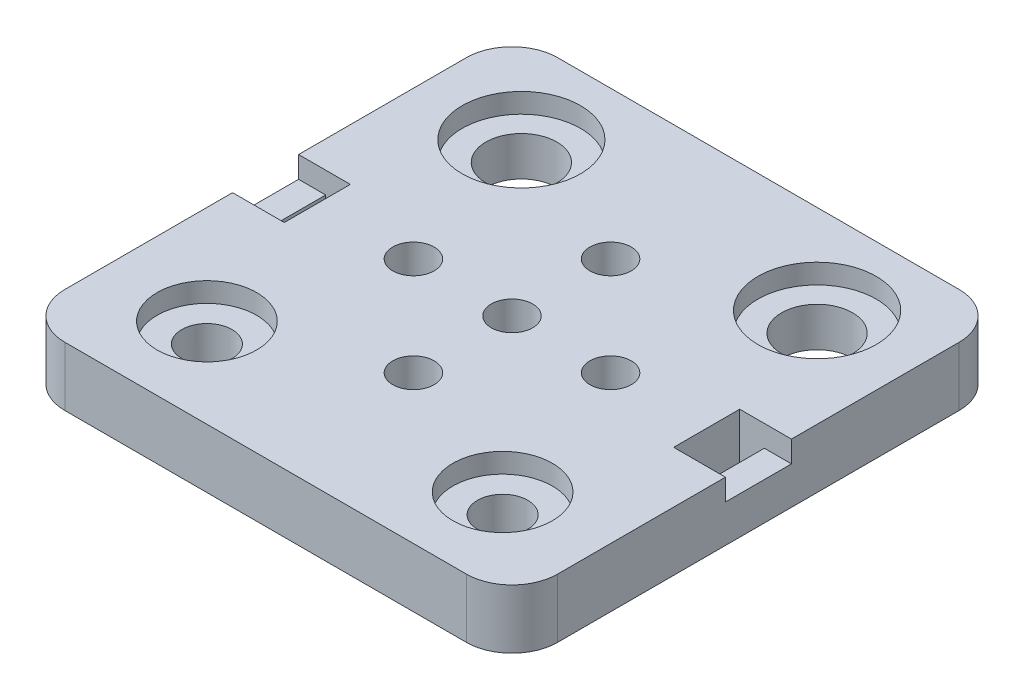
ISO-10303-21;
HEADER;
FILE_DESCRIPTION(('STEP AP214'),'2;1');
FILE_NAME('part.step','',(''),(''),'','','');
FILE_SCHEMA(('AUTOMOTIVE_DESIGN { 1 0 10303 214 1 1 1 1 }'));
ENDSEC;
DATA;
#1=APPLICATION_CONTEXT('core data for automotive mechanical design processes');
#2=APPLICATION_PROTOCOL_DEFINITION('international standard','automotive_design',2000,#1);
#3=PRODUCT_CONTEXT('',#1,'mechanical');
#4=PRODUCT('Part','Part','',(#3));
#5=PRODUCT_RELATED_PRODUCT_CATEGORY('part','',(#4));
#6=PRODUCT_DEFINITION_FORMATION('','',#4);
#7=PRODUCT_DEFINITION_CONTEXT('part definition',#1,'design');
#8=PRODUCT_DEFINITION('design','',#6,#7);
#9=PRODUCT_DEFINITION_SHAPE('','',#8);
#10=(LENGTH_UNIT() NAMED_UNIT(*) SI_UNIT(.MILLI.,.METRE.));
#11=(NAMED_UNIT(*) PLANE_ANGLE_UNIT() SI_UNIT($,.RADIAN.));
#12=(NAMED_UNIT(*) SI_UNIT($,.STERADIAN.) SOLID_ANGLE_UNIT());
#13=UNCERTAINTY_MEASURE_WITH_UNIT(LENGTH_MEASURE(1.E-05),#10,'distance_accuracy_value','');
#14=(GEOMETRIC_REPRESENTATION_CONTEXT(3) GLOBAL_UNCERTAINTY_ASSIGNED_CONTEXT((#13)) GLOBAL_UNIT_ASSIGNED_CONTEXT((#10,
#11,#12)) REPRESENTATION_CONTEXT('',''));
#15=CARTESIAN_POINT('',(0.,0.,0.));
#16=DIRECTION('',(0.,0.,1.));
#17=DIRECTION('',(1.,0.,0.));
#18=AXIS2_PLACEMENT_3D('',#15,#16,#17);
#19=CARTESIAN_POINT('',(-15.,6.,15.95));
#20=DIRECTION('',(0.,-1.,0.));
#21=DIRECTION('',(0.,0.,-1.));
#22=AXIS2_PLACEMENT_3D('',#19,#20,#21);
#23=CYLINDRICAL_SURFACE('',#22,2.55);
#24=CARTESIAN_POINT('',(-15.,0.,15.95));
#25=DIRECTION('',(0.,1.,0.));
#26=DIRECTION('',(0.,0.,-1.));
#27=AXIS2_PLACEMENT_3D('',#24,#25,#26);
#28=CIRCLE('',#27,2.55);
#29=CARTESIAN_POINT('',(-15.,0.,13.4));
#30=VERTEX_POINT('',#29);
#31=EDGE_CURVE('E323',#30,#30,#28,.T.);
#32=ORIENTED_EDGE('',*,*,#31,.F.);
#33=EDGE_LOOP('',(#32));
#34=FACE_BOUND('',#33,.T.);
#35=CARTESIAN_POINT('',(-15.,4.,15.95));
#36=DIRECTION('',(0.,1.,0.));
#37=DIRECTION('',(0.,0.,1.));
#38=AXIS2_PLACEMENT_3D('',#35,#36,#37);
#39=CIRCLE('',#38,2.55);
#40=CARTESIAN_POINT('',(-15.,4.,18.5));
#41=VERTEX_POINT('',#40);
#42=EDGE_CURVE('E38',#41,#41,#39,.T.);
#43=ORIENTED_EDGE('',*,*,#42,.T.);
#44=EDGE_LOOP('',(#43));
#45=FACE_BOUND('',#44,.T.);
#46=ADVANCED_FACE('F34',(#34,#45),#23,.F.);
#47=CARTESIAN_POINT('',(15.,6.,15.95));
#48=DIRECTION('',(0.,-1.,0.));
#49=DIRECTION('',(0.,0.,-1.));
#50=AXIS2_PLACEMENT_3D('',#47,#48,#49);
#51=CYLINDRICAL_SURFACE('',#50,2.55);
#52=CARTESIAN_POINT('',(15.,0.,15.95));
#53=DIRECTION('',(0.,1.,0.));
#54=DIRECTION('',(0.,0.,1.));
#55=AXIS2_PLACEMENT_3D('',#52,#53,#54);
#56=CIRCLE('',#55,2.55);
#57=CARTESIAN_POINT('',(15.,0.,18.5));
#58=VERTEX_POINT('',#57);
#59=EDGE_CURVE('E326',#58,#58,#56,.T.);
#60=ORIENTED_EDGE('',*,*,#59,.F.);
#61=EDGE_LOOP('',(#60));
#62=FACE_BOUND('',#61,.T.);
#63=CARTESIAN_POINT('',(15.,4.,15.95));
#64=DIRECTION('',(0.,1.,0.));
#65=DIRECTION('',(0.,0.,1.));
#66=AXIS2_PLACEMENT_3D('',#63,#64,#65);
#67=CIRCLE('',#66,2.55);
#68=CARTESIAN_POINT('',(15.,4.,18.5));
#69=VERTEX_POINT('',#68);
#70=EDGE_CURVE('E275',#69,#69,#67,.T.);
#71=ORIENTED_EDGE('',*,*,#70,.T.);
#72=EDGE_LOOP('',(#71));
#73=FACE_BOUND('',#72,.T.);
#74=ADVANCED_FACE('F399',(#62,#73),#51,.F.);
#75=CARTESIAN_POINT('',(15.,6.,-15.95));
#76=DIRECTION('',(0.,-1.,0.));
#77=DIRECTION('',(0.,0.,-1.));
#78=AXIS2_PLACEMENT_3D('',#75,#76,#77);
#79=CYLINDRICAL_SURFACE('',#78,3.6);
#80=CARTESIAN_POINT('',(15.,0.,-15.95));
#81=DIRECTION('',(0.,1.,0.));
#82=DIRECTION('',(0.,0.,-1.));
#83=AXIS2_PLACEMENT_3D('',#80,#81,#82);
#84=CIRCLE('',#83,3.6);
#85=CARTESIAN_POINT('',(15.,0.,-19.55));
#86=VERTEX_POINT('',#85);
#87=EDGE_CURVE('E329',#86,#86,#84,.T.);
#88=ORIENTED_EDGE('',*,*,#87,.F.);
#89=EDGE_LOOP('',(#88));
#90=FACE_BOUND('',#89,.T.);
#91=CARTESIAN_POINT('',(15.,4.,-15.95));
#92=DIRECTION('',(0.,1.,0.));
#93=DIRECTION('',(0.,0.,1.));
#94=AXIS2_PLACEMENT_3D('',#91,#92,#93);
#95=CIRCLE('',#94,3.6);
#96=CARTESIAN_POINT('',(15.,4.,-12.35));
#97=VERTEX_POINT('',#96);
#98=EDGE_CURVE('E282',#97,#97,#95,.T.);
#99=ORIENTED_EDGE('',*,*,#98,.T.);
#100=EDGE_LOOP('',(#99));
#101=FACE_BOUND('',#100,.T.);
#102=ADVANCED_FACE('F458',(#90,#101),#79,.F.);
#103=CARTESIAN_POINT('',(-15.,6.,-15.95));
#104=DIRECTION('',(0.,-1.,0.));
#105=DIRECTION('',(0.,0.,-1.));
#106=AXIS2_PLACEMENT_3D('',#103,#104,#105);
#107=CYLINDRICAL_SURFACE('',#106,3.6);
#108=CARTESIAN_POINT('',(-15.,0.,-15.95));
#109=DIRECTION('',(0.,1.,0.));
#110=DIRECTION('',(0.,0.,1.));
#111=AXIS2_PLACEMENT_3D('',#108,#109,#110);
#112=CIRCLE('',#111,3.6);
#113=CARTESIAN_POINT('',(-15.,0.,-12.35));
#114=VERTEX_POINT('',#113);
#115=EDGE_CURVE('E332',#114,#114,#112,.T.);
#116=ORIENTED_EDGE('',*,*,#115,.F.);
#117=EDGE_LOOP('',(#116));
#118=FACE_BOUND('',#117,.T.);
#119=CARTESIAN_POINT('',(-15.,4.,-15.95));
#120=DIRECTION('',(0.,1.,0.));
#121=DIRECTION('',(0.,0.,1.));
#122=AXIS2_PLACEMENT_3D('',#119,#120,#121);
#123=CIRCLE('',#122,3.6);
#124=CARTESIAN_POINT('',(-15.,4.,-12.35));
#125=VERTEX_POINT('',#124);
#126=EDGE_CURVE('E289',#125,#125,#123,.T.);
#127=ORIENTED_EDGE('',*,*,#126,.T.);
#128=EDGE_LOOP('',(#127));
#129=FACE_BOUND('',#128,.T.);
#130=ADVANCED_FACE('F418',(#118,#129),#107,.F.);
#131=CARTESIAN_POINT('',(-20.365,6.,-20.365));
#132=DIRECTION('',(0.,1.,0.));
#133=DIRECTION('',(0.,0.,1.));
#134=AXIS2_PLACEMENT_3D('',#131,#132,#133);
#135=PLANE('',#134);
#136=DIRECTION('',(-1.,0.,0.));
#137=VECTOR('',#136,1.);
#138=CARTESIAN_POINT('',(25.,6.,-3.35));
#139=LINE('',#138,#137);
#140=CARTESIAN_POINT('',(25.,6.,-3.35));
#141=VERTEX_POINT('',#140);
#142=CARTESIAN_POINT('',(19.75,6.,-3.35));
#143=VERTEX_POINT('',#142);
#144=EDGE_CURVE('E180',#141,#143,#139,.T.);
#145=ORIENTED_EDGE('',*,*,#144,.F.);
#146=DIRECTION('',(0.,0.,-1.));
#147=VECTOR('',#146,1.);
#148=CARTESIAN_POINT('',(25.,6.,20.365));
#149=LINE('',#148,#147);
#150=CARTESIAN_POINT('',(25.,6.,-20.365));
#151=VERTEX_POINT('',#150);
#152=EDGE_CURVE('E350',#141,#151,#149,.T.);
#153=ORIENTED_EDGE('',*,*,#152,.T.);
#154=CARTESIAN_POINT('',(20.365,6.,-20.365));
#155=DIRECTION('',(0.,1.,0.));
#156=DIRECTION('',(0.,0.,1.));
#157=AXIS2_PLACEMENT_3D('',#154,#155,#156);
#158=CIRCLE('',#157,4.635);
#159=CARTESIAN_POINT('',(20.365,6.,-25.));
#160=VERTEX_POINT('',#159);
#161=EDGE_CURVE('E354',#151,#160,#158,.T.);
#162=ORIENTED_EDGE('',*,*,#161,.T.);
#163=DIRECTION('',(-1.,0.,0.));
#164=VECTOR('',#163,1.);
#165=CARTESIAN_POINT('',(20.365,6.,-25.));
#166=LINE('',#165,#164);
#167=CARTESIAN_POINT('',(-20.365,6.,-25.));
#168=VERTEX_POINT('',#167);
#169=EDGE_CURVE('E356',#160,#168,#166,.T.);
#170=ORIENTED_EDGE('',*,*,#169,.T.);
#171=CARTESIAN_POINT('',(-20.365,6.,-20.365));
#172=DIRECTION('',(0.,1.,0.));
#173=DIRECTION('',(0.,0.,1.));
#174=AXIS2_PLACEMENT_3D('',#171,#172,#173);
#175=CIRCLE('',#174,4.635);
#176=CARTESIAN_POINT('',(-25.,6.,-20.365));
#177=VERTEX_POINT('',#176);
#178=EDGE_CURVE('E336',#168,#177,#175,.T.);
#179=ORIENTED_EDGE('',*,*,#178,.T.);
#180=DIRECTION('',(0.,0.,1.));
#181=VECTOR('',#180,1.);
#182=CARTESIAN_POINT('',(-25.,6.,20.365));
#183=LINE('',#182,#181);
#184=CARTESIAN_POINT('',(-25.,6.,-3.35));
#185=VERTEX_POINT('',#184);
#186=EDGE_CURVE('E341',#177,#185,#183,.T.);
#187=ORIENTED_EDGE('',*,*,#186,.T.);
#188=DIRECTION('',(-1.,0.,0.));
#189=VECTOR('',#188,1.);
#190=CARTESIAN_POINT('',(-25.,6.,-3.35));
#191=LINE('',#190,#189);
#192=CARTESIAN_POINT('',(-19.75,6.,-3.35));
#193=VERTEX_POINT('',#192);
#194=EDGE_CURVE('E246',#193,#185,#191,.T.);
#195=ORIENTED_EDGE('',*,*,#194,.F.);
#196=DIRECTION('',(0.,0.,-1.));
#197=VECTOR('',#196,1.);
#198=CARTESIAN_POINT('',(-19.75,6.,-3.35));
#199=LINE('',#198,#197);
#200=CARTESIAN_POINT('',(-19.75,6.,3.35));
#201=VERTEX_POINT('',#200);
#202=EDGE_CURVE('E254',#201,#193,#199,.T.);
#203=ORIENTED_EDGE('',*,*,#202,.F.);
#204=DIRECTION('',(1.,0.,0.));
#205=VECTOR('',#204,1.);
#206=CARTESIAN_POINT('',(-25.,6.,3.35));
#207=LINE('',#206,#205);
#208=CARTESIAN_POINT('',(-25.,6.,3.35));
#209=VERTEX_POINT('',#208);
#210=EDGE_CURVE('E237',#209,#201,#207,.T.);
#211=ORIENTED_EDGE('',*,*,#210,.F.);
#212=CARTESIAN_POINT('',(-25.,6.,20.365));
#213=VERTEX_POINT('',#212);
#214=EDGE_CURVE('E339',#209,#213,#183,.T.);
#215=ORIENTED_EDGE('',*,*,#214,.T.);
#216=CARTESIAN_POINT('',(-20.365,6.,20.365));
#217=DIRECTION('',(0.,1.,0.));
#218=DIRECTION('',(0.,0.,-1.));
#219=AXIS2_PLACEMENT_3D('',#216,#217,#218);
#220=CIRCLE('',#219,4.635);
#221=CARTESIAN_POINT('',(-20.365,6.,25.));
#222=VERTEX_POINT('',#221);
#223=EDGE_CURVE('E344',#213,#222,#220,.T.);
#224=ORIENTED_EDGE('',*,*,#223,.T.);
#225=DIRECTION('',(1.,0.,0.));
#226=VECTOR('',#225,1.);
#227=CARTESIAN_POINT('',(20.365,6.,25.));
#228=LINE('',#227,#226);
#229=CARTESIAN_POINT('',(20.365,6.,25.));
#230=VERTEX_POINT('',#229);
#231=EDGE_CURVE('E346',#222,#230,#228,.T.);
#232=ORIENTED_EDGE('',*,*,#231,.T.);
#233=CARTESIAN_POINT('',(20.365,6.,20.365));
#234=DIRECTION('',(0.,1.,0.));
#235=DIRECTION('',(0.,0.,1.));
#236=AXIS2_PLACEMENT_3D('',#233,#234,#235);
#237=CIRCLE('',#236,4.635);
#238=CARTESIAN_POINT('',(25.,6.,20.365));
#239=VERTEX_POINT('',#238);
#240=EDGE_CURVE('E348',#230,#239,#237,.T.);
#241=ORIENTED_EDGE('',*,*,#240,.T.);
#242=CARTESIAN_POINT('',(25.,6.,3.35));
#243=VERTEX_POINT('',#242);
#244=EDGE_CURVE('E351',#239,#243,#149,.T.);
#245=ORIENTED_EDGE('',*,*,#244,.T.);
#246=DIRECTION('',(1.,0.,0.));
#247=VECTOR('',#246,1.);
#248=CARTESIAN_POINT('',(25.,6.,3.35));
#249=LINE('',#248,#247);
#250=CARTESIAN_POINT('',(19.75,6.,3.35));
#251=VERTEX_POINT('',#250);
#252=EDGE_CURVE('E227',#251,#243,#249,.T.);
#253=ORIENTED_EDGE('',*,*,#252,.F.);
#254=DIRECTION('',(0.,0.,1.));
#255=VECTOR('',#254,1.);
#256=CARTESIAN_POINT('',(19.75,6.,-3.35));
#257=LINE('',#256,#255);
#258=EDGE_CURVE('E232',#143,#251,#257,.T.);
#259=ORIENTED_EDGE('',*,*,#258,.F.);
#260=EDGE_LOOP('',(#145,#153,#162,#170,#179,#187,#195,#203,#211,#215,#224,#232,#241,#245,#253,#259));
#261=FACE_BOUND('',#260,.T.);
#262=CARTESIAN_POINT('',(-15.,6.,15.95));
#263=DIRECTION('',(0.,1.,0.));
#264=DIRECTION('',(0.,0.,1.));
#265=AXIS2_PLACEMENT_3D('',#262,#263,#264);
#266=CIRCLE('',#265,5.05);
#267=CARTESIAN_POINT('',(-15.,6.,21.));
#268=VERTEX_POINT('',#267);
#269=EDGE_CURVE('E261',#268,#268,#266,.T.);
#270=ORIENTED_EDGE('',*,*,#269,.F.);
#271=EDGE_LOOP('',(#270));
#272=FACE_BOUND('',#271,.T.);
#273=CARTESIAN_POINT('',(15.,6.,15.95));
#274=DIRECTION('',(0.,1.,0.));
#275=DIRECTION('',(0.,0.,1.));
#276=AXIS2_PLACEMENT_3D('',#273,#274,#275);
#277=CIRCLE('',#276,5.05);
#278=CARTESIAN_POINT('',(15.,6.,21.));
#279=VERTEX_POINT('',#278);
#280=EDGE_CURVE('E276',#279,#279,#277,.T.);
#281=ORIENTED_EDGE('',*,*,#280,.F.);
#282=EDGE_LOOP('',(#281));
#283=FACE_BOUND('',#282,.T.);
#284=CARTESIAN_POINT('',(15.,6.,-15.95));
#285=DIRECTION('',(0.,1.,0.));
#286=DIRECTION('',(0.,0.,1.));
#287=AXIS2_PLACEMENT_3D('',#284,#285,#286);
#288=CIRCLE('',#287,6.00000000000001);
#289=CARTESIAN_POINT('',(15.,6.,-9.94999999999998));
#290=VERTEX_POINT('',#289);
#291=EDGE_CURVE('E283',#290,#290,#288,.T.);
#292=ORIENTED_EDGE('',*,*,#291,.F.);
#293=EDGE_LOOP('',(#292));
#294=FACE_BOUND('',#293,.T.);
#295=CARTESIAN_POINT('',(-15.,6.,-15.95));
#296=DIRECTION('',(0.,1.,0.));
#297=DIRECTION('',(0.,0.,1.));
#298=AXIS2_PLACEMENT_3D('',#295,#296,#297);
#299=CIRCLE('',#298,6.);
#300=CARTESIAN_POINT('',(-15.,6.,-9.94999999999998));
#301=VERTEX_POINT('',#300);
#302=EDGE_CURVE('E290',#301,#301,#299,.T.);
#303=ORIENTED_EDGE('',*,*,#302,.F.);
#304=EDGE_LOOP('',(#303));
#305=FACE_BOUND('',#304,.T.);
#306=CARTESIAN_POINT('',(0.,6.,-10.));
#307=DIRECTION('',(0.,1.,0.));
#308=DIRECTION('',(0.,0.,1.));
#309=AXIS2_PLACEMENT_3D('',#306,#307,#308);
#310=CIRCLE('',#309,2.1);
#311=CARTESIAN_POINT('',(0.,6.,-7.9));
#312=VERTEX_POINT('',#311);
#313=EDGE_CURVE('E293',#312,#312,#310,.T.);
#314=ORIENTED_EDGE('',*,*,#313,.F.);
#315=EDGE_LOOP('',(#314));
#316=FACE_BOUND('',#315,.T.);
#317=CARTESIAN_POINT('',(-10.,6.,0.));
#318=DIRECTION('',(0.,1.,0.));
#319=DIRECTION('',(0.,0.,1.));
#320=AXIS2_PLACEMENT_3D('',#317,#318,#319);
#321=CIRCLE('',#320,2.1);
#322=CARTESIAN_POINT('',(-10.,6.,2.1));
#323=VERTEX_POINT('',#322);
#324=EDGE_CURVE('E299',#323,#323,#321,.T.);
#325=ORIENTED_EDGE('',*,*,#324,.F.);
#326=EDGE_LOOP('',(#325));
#327=FACE_BOUND('',#326,.T.);
#328=CARTESIAN_POINT('',(0.,6.,0.));
#329=DIRECTION('',(0.,1.,0.));
#330=DIRECTION('',(0.,0.,1.));
#331=AXIS2_PLACEMENT_3D('',#328,#329,#330);
#332=CIRCLE('',#331,2.1);
#333=CARTESIAN_POINT('',(0.,6.,2.1));
#334=VERTEX_POINT('',#333);
#335=EDGE_CURVE('E305',#334,#334,#332,.T.);
#336=ORIENTED_EDGE('',*,*,#335,.F.);
#337=EDGE_LOOP('',(#336));
#338=FACE_BOUND('',#337,.T.);
#339=CARTESIAN_POINT('',(0.,6.,10.));
#340=DIRECTION('',(0.,1.,0.));
#341=DIRECTION('',(0.,0.,1.));
#342=AXIS2_PLACEMENT_3D('',#339,#340,#341);
#343=CIRCLE('',#342,2.1);
#344=CARTESIAN_POINT('',(0.,6.,12.1));
#345=VERTEX_POINT('',#344);
#346=EDGE_CURVE('E311',#345,#345,#343,.T.);
#347=ORIENTED_EDGE('',*,*,#346,.F.);
#348=EDGE_LOOP('',(#347));
#349=FACE_BOUND('',#348,.T.);
#350=CARTESIAN_POINT('',(10.,6.,0.));
#351=DIRECTION('',(0.,1.,0.));
#352=DIRECTION('',(0.,0.,1.));
#353=AXIS2_PLACEMENT_3D('',#350,#351,#352);
#354=CIRCLE('',#353,2.1);
#355=CARTESIAN_POINT('',(10.,6.,2.1));
#356=VERTEX_POINT('',#355);
#357=EDGE_CURVE('E317',#356,#356,#354,.T.);
#358=ORIENTED_EDGE('',*,*,#357,.F.);
#359=EDGE_LOOP('',(#358));
#360=FACE_BOUND('',#359,.T.);
#361=ADVANCED_FACE('F415',(#261,#272,#283,#294,#305,#316,#327,#338,#349,#360),#135,.T.);
#362=CARTESIAN_POINT('',(-20.365,0.,-20.365));
#363=DIRECTION('',(0.,1.,0.));
#364=DIRECTION('',(0.,0.,1.));
#365=AXIS2_PLACEMENT_3D('',#362,#363,#364);
#366=PLANE('',#365);
#367=DIRECTION('',(0.,0.,-1.));
#368=VECTOR('',#367,1.);
#369=CARTESIAN_POINT('',(22.25,0.,-3.35));
#370=LINE('',#369,#368);
#371=CARTESIAN_POINT('',(22.25,0.,3.35));
#372=VERTEX_POINT('',#371);
#373=CARTESIAN_POINT('',(22.25,0.,-3.35));
#374=VERTEX_POINT('',#373);
#375=EDGE_CURVE('E194',#372,#374,#370,.T.);
#376=ORIENTED_EDGE('',*,*,#375,.T.);
#377=DIRECTION('',(-1.,0.,0.));
#378=VECTOR('',#377,1.);
#379=CARTESIAN_POINT('',(19.75,0.,-3.35));
#380=LINE('',#379,#378);
#381=CARTESIAN_POINT('',(19.75,0.,-3.35));
#382=VERTEX_POINT('',#381);
#383=EDGE_CURVE('E177',#374,#382,#380,.T.);
#384=ORIENTED_EDGE('',*,*,#383,.T.);
#385=DIRECTION('',(0.,0.,1.));
#386=VECTOR('',#385,1.);
#387=CARTESIAN_POINT('',(19.75,0.,-3.35));
#388=LINE('',#387,#386);
#389=CARTESIAN_POINT('',(19.75,0.,3.35));
#390=VERTEX_POINT('',#389);
#391=EDGE_CURVE('E185',#382,#390,#388,.T.);
#392=ORIENTED_EDGE('',*,*,#391,.T.);
#393=DIRECTION('',(1.,0.,0.));
#394=VECTOR('',#393,1.);
#395=CARTESIAN_POINT('',(19.75,0.,3.35));
#396=LINE('',#395,#394);
#397=EDGE_CURVE('E189',#390,#372,#396,.T.);
#398=ORIENTED_EDGE('',*,*,#397,.T.);
#399=EDGE_LOOP('',(#376,#384,#392,#398));
#400=FACE_BOUND('',#399,.T.);
#401=DIRECTION('',(1.,0.,0.));
#402=VECTOR('',#401,1.);
#403=CARTESIAN_POINT('',(-19.75,0.,3.35));
#404=LINE('',#403,#402);
#405=CARTESIAN_POINT('',(-22.25,0.,3.35));
#406=VERTEX_POINT('',#405);
#407=CARTESIAN_POINT('',(-19.75,0.,3.35));
#408=VERTEX_POINT('',#407);
#409=EDGE_CURVE('E214',#406,#408,#404,.T.);
#410=ORIENTED_EDGE('',*,*,#409,.T.);
#411=DIRECTION('',(0.,0.,-1.));
#412=VECTOR('',#411,1.);
#413=CARTESIAN_POINT('',(-19.75,0.,-3.35));
#414=LINE('',#413,#412);
#415=CARTESIAN_POINT('',(-19.75,0.,-3.35));
#416=VERTEX_POINT('',#415);
#417=EDGE_CURVE('E207',#408,#416,#414,.T.);
#418=ORIENTED_EDGE('',*,*,#417,.T.);
#419=DIRECTION('',(-1.,0.,0.));
#420=VECTOR('',#419,1.);
#421=CARTESIAN_POINT('',(-19.75,0.,-3.35));
#422=LINE('',#421,#420);
#423=CARTESIAN_POINT('',(-22.25,0.,-3.35));
#424=VERTEX_POINT('',#423);
#425=EDGE_CURVE('E210',#416,#424,#422,.T.);
#426=ORIENTED_EDGE('',*,*,#425,.T.);
#427=DIRECTION('',(0.,0.,1.));
#428=VECTOR('',#427,1.);
#429=CARTESIAN_POINT('',(-22.25,0.,-3.35));
#430=LINE('',#429,#428);
#431=EDGE_CURVE('E59',#424,#406,#430,.T.);
#432=ORIENTED_EDGE('',*,*,#431,.T.);
#433=EDGE_LOOP('',(#410,#418,#426,#432));
#434=FACE_BOUND('',#433,.T.);
#435=CARTESIAN_POINT('',(0.,0.,-10.));
#436=DIRECTION('',(0.,1.,0.));
#437=DIRECTION('',(0.,0.,1.));
#438=AXIS2_PLACEMENT_3D('',#435,#436,#437);
#439=CIRCLE('',#438,2.1);
#440=CARTESIAN_POINT('',(0.,0.,-7.9));
#441=VERTEX_POINT('',#440);
#442=EDGE_CURVE('E296',#441,#441,#439,.T.);
#443=ORIENTED_EDGE('',*,*,#442,.T.);
#444=EDGE_LOOP('',(#443));
#445=FACE_BOUND('',#444,.T.);
#446=CARTESIAN_POINT('',(-10.,0.,0.));
#447=DIRECTION('',(0.,1.,0.));
#448=DIRECTION('',(0.,0.,1.));
#449=AXIS2_PLACEMENT_3D('',#446,#447,#448);
#450=CIRCLE('',#449,2.1);
#451=CARTESIAN_POINT('',(-10.,0.,2.1));
#452=VERTEX_POINT('',#451);
#453=EDGE_CURVE('E302',#452,#452,#450,.T.);
#454=ORIENTED_EDGE('',*,*,#453,.T.);
#455=EDGE_LOOP('',(#454));
#456=FACE_BOUND('',#455,.T.);
#457=CARTESIAN_POINT('',(0.,0.,0.));
#458=DIRECTION('',(0.,1.,0.));
#459=DIRECTION('',(0.,0.,1.));
#460=AXIS2_PLACEMENT_3D('',#457,#458,#459);
#461=CIRCLE('',#460,2.1);
#462=CARTESIAN_POINT('',(0.,0.,2.1));
#463=VERTEX_POINT('',#462);
#464=EDGE_CURVE('E308',#463,#463,#461,.T.);
#465=ORIENTED_EDGE('',*,*,#464,.T.);
#466=EDGE_LOOP('',(#465));
#467=FACE_BOUND('',#466,.T.);
#468=CARTESIAN_POINT('',(0.,0.,10.));
#469=DIRECTION('',(0.,1.,0.));
#470=DIRECTION('',(0.,0.,1.));
#471=AXIS2_PLACEMENT_3D('',#468,#469,#470);
#472=CIRCLE('',#471,2.1);
#473=CARTESIAN_POINT('',(0.,0.,12.1));
#474=VERTEX_POINT('',#473);
#475=EDGE_CURVE('E314',#474,#474,#472,.T.);
#476=ORIENTED_EDGE('',*,*,#475,.T.);
#477=EDGE_LOOP('',(#476));
#478=FACE_BOUND('',#477,.T.);
#479=CARTESIAN_POINT('',(10.,0.,0.));
#480=DIRECTION('',(0.,1.,0.));
#481=DIRECTION('',(0.,0.,1.));
#482=AXIS2_PLACEMENT_3D('',#479,#480,#481);
#483=CIRCLE('',#482,2.1);
#484=CARTESIAN_POINT('',(10.,0.,2.1));
#485=VERTEX_POINT('',#484);
#486=EDGE_CURVE('E320',#485,#485,#483,.T.);
#487=ORIENTED_EDGE('',*,*,#486,.T.);
#488=EDGE_LOOP('',(#487));
#489=FACE_BOUND('',#488,.T.);
#490=ORIENTED_EDGE('',*,*,#59,.T.);
#491=EDGE_LOOP('',(#490));
#492=FACE_BOUND('',#491,.T.);
#493=ORIENTED_EDGE('',*,*,#115,.T.);
#494=EDGE_LOOP('',(#493));
#495=FACE_BOUND('',#494,.T.);
#496=CARTESIAN_POINT('',(-20.365,0.,-20.365));
#497=DIRECTION('',(0.,1.,0.));
#498=DIRECTION('',(0.,0.,1.));
#499=AXIS2_PLACEMENT_3D('',#496,#497,#498);
#500=CIRCLE('',#499,4.635);
#501=CARTESIAN_POINT('',(-20.365,0.,-25.));
#502=VERTEX_POINT('',#501);
#503=CARTESIAN_POINT('',(-25.,0.,-20.365));
#504=VERTEX_POINT('',#503);
#505=EDGE_CURVE('E335',#502,#504,#500,.T.);
#506=ORIENTED_EDGE('',*,*,#505,.F.);
#507=DIRECTION('',(-1.,0.,0.));
#508=VECTOR('',#507,1.);
#509=CARTESIAN_POINT('',(20.365,0.,-25.));
#510=LINE('',#509,#508);
#511=CARTESIAN_POINT('',(20.365,0.,-25.));
#512=VERTEX_POINT('',#511);
#513=EDGE_CURVE('E340',#512,#502,#510,.T.);
#514=ORIENTED_EDGE('',*,*,#513,.F.);
#515=CARTESIAN_POINT('',(20.365,0.,-20.365));
#516=DIRECTION('',(0.,1.,0.));
#517=DIRECTION('',(0.,0.,1.));
#518=AXIS2_PLACEMENT_3D('',#515,#516,#517);
#519=CIRCLE('',#518,4.635);
#520=CARTESIAN_POINT('',(25.,0.,-20.365));
#521=VERTEX_POINT('',#520);
#522=EDGE_CURVE('E371',#521,#512,#519,.T.);
#523=ORIENTED_EDGE('',*,*,#522,.F.);
#524=DIRECTION('',(0.,0.,-1.));
#525=VECTOR('',#524,1.);
#526=CARTESIAN_POINT('',(25.,0.,20.365));
#527=LINE('',#526,#525);
#528=CARTESIAN_POINT('',(25.,0.,20.365));
#529=VERTEX_POINT('',#528);
#530=EDGE_CURVE('E369',#529,#521,#527,.T.);
#531=ORIENTED_EDGE('',*,*,#530,.F.);
#532=CARTESIAN_POINT('',(20.365,0.,20.365));
#533=DIRECTION('',(0.,1.,0.));
#534=DIRECTION('',(0.,0.,1.));
#535=AXIS2_PLACEMENT_3D('',#532,#533,#534);
#536=CIRCLE('',#535,4.635);
#537=CARTESIAN_POINT('',(20.365,0.,25.));
#538=VERTEX_POINT('',#537);
#539=EDGE_CURVE('E367',#538,#529,#536,.T.);
#540=ORIENTED_EDGE('',*,*,#539,.F.);
#541=DIRECTION('',(1.,0.,0.));
#542=VECTOR('',#541,1.);
#543=CARTESIAN_POINT('',(20.365,0.,25.));
#544=LINE('',#543,#542);
#545=CARTESIAN_POINT('',(-20.365,0.,25.));
#546=VERTEX_POINT('',#545);
#547=EDGE_CURVE('E365',#546,#538,#544,.T.);
#548=ORIENTED_EDGE('',*,*,#547,.F.);
#549=CARTESIAN_POINT('',(-20.365,0.,20.365));
#550=DIRECTION('',(0.,1.,0.));
#551=DIRECTION('',(0.,0.,-1.));
#552=AXIS2_PLACEMENT_3D('',#549,#550,#551);
#553=CIRCLE('',#552,4.635);
#554=CARTESIAN_POINT('',(-25.,0.,20.365));
#555=VERTEX_POINT('',#554);
#556=EDGE_CURVE('E363',#555,#546,#553,.T.);
#557=ORIENTED_EDGE('',*,*,#556,.F.);
#558=DIRECTION('',(0.,0.,1.));
#559=VECTOR('',#558,1.);
#560=CARTESIAN_POINT('',(-25.,0.,20.365));
#561=LINE('',#560,#559);
#562=EDGE_CURVE('E361',#504,#555,#561,.T.);
#563=ORIENTED_EDGE('',*,*,#562,.F.);
#564=EDGE_LOOP('',(#506,#514,#523,#531,#540,#548,#557,#563));
#565=FACE_BOUND('',#564,.T.);
#566=ORIENTED_EDGE('',*,*,#87,.T.);
#567=EDGE_LOOP('',(#566));
#568=FACE_BOUND('',#567,.T.);
#569=ORIENTED_EDGE('',*,*,#31,.T.);
#570=EDGE_LOOP('',(#569));
#571=FACE_BOUND('',#570,.T.);
#572=ADVANCED_FACE('F191',(#400,#434,#445,#456,#467,#478,#489,#492,#495,#565,#568,#571),#366,.F.);
#573=CARTESIAN_POINT('',(-20.365,6.,-20.365));
#574=DIRECTION('',(0.,-1.,0.));
#575=DIRECTION('',(0.,0.,-1.));
#576=AXIS2_PLACEMENT_3D('',#573,#574,#575);
#577=CYLINDRICAL_SURFACE('',#576,4.635);
#578=ORIENTED_EDGE('',*,*,#505,.T.);
#579=DIRECTION('',(0.,-1.,0.));
#580=VECTOR('',#579,1.);
#581=CARTESIAN_POINT('',(-25.,6.,-20.365));
#582=LINE('',#581,#580);
#583=EDGE_CURVE('E11',#177,#504,#582,.T.);
#584=ORIENTED_EDGE('',*,*,#583,.F.);
#585=ORIENTED_EDGE('',*,*,#178,.F.);
#586=DIRECTION('',(0.,-1.,0.));
#587=VECTOR('',#586,1.);
#588=CARTESIAN_POINT('',(-20.365,6.,-25.));
#589=LINE('',#588,#587);
#590=EDGE_CURVE('E358',#168,#502,#589,.T.);
#591=ORIENTED_EDGE('',*,*,#590,.T.);
#592=EDGE_LOOP('',(#578,#584,#585,#591));
#593=FACE_BOUND('',#592,.T.);
#594=ADVANCED_FACE('F36',(#593),#577,.T.);
#595=CARTESIAN_POINT('',(-25.,6.,20.365));
#596=DIRECTION('',(1.,0.,0.));
#597=DIRECTION('',(0.,0.,-1.));
#598=AXIS2_PLACEMENT_3D('',#595,#596,#597);
#599=PLANE('',#598);
#600=DIRECTION('',(0.,0.,1.));
#601=VECTOR('',#600,1.);
#602=CARTESIAN_POINT('',(-25.,3.82,-3.35));
#603=LINE('',#602,#601);
#604=CARTESIAN_POINT('',(-25.,3.82,-3.35));
#605=VERTEX_POINT('',#604);
#606=CARTESIAN_POINT('',(-25.,3.82,3.35));
#607=VERTEX_POINT('',#606);
#608=EDGE_CURVE('E242',#605,#607,#603,.T.);
#609=ORIENTED_EDGE('',*,*,#608,.F.);
#610=DIRECTION('',(0.,1.,0.));
#611=VECTOR('',#610,1.);
#612=CARTESIAN_POINT('',(-25.,3.82,-3.35));
#613=LINE('',#612,#611);
#614=EDGE_CURVE('E258',#605,#185,#613,.T.);
#615=ORIENTED_EDGE('',*,*,#614,.T.);
#616=ORIENTED_EDGE('',*,*,#186,.F.);
#617=ORIENTED_EDGE('',*,*,#583,.T.);
#618=ORIENTED_EDGE('',*,*,#562,.T.);
#619=DIRECTION('',(0.,-1.,0.));
#620=VECTOR('',#619,1.);
#621=CARTESIAN_POINT('',(-25.,6.,20.365));
#622=LINE('',#621,#620);
#623=EDGE_CURVE('E43',#213,#555,#622,.T.);
#624=ORIENTED_EDGE('',*,*,#623,.F.);
#625=ORIENTED_EDGE('',*,*,#214,.F.);
#626=DIRECTION('',(0.,1.,0.));
#627=VECTOR('',#626,1.);
#628=CARTESIAN_POINT('',(-25.,3.82,3.35));
#629=LINE('',#628,#627);
#630=EDGE_CURVE('E251',#607,#209,#629,.T.);
#631=ORIENTED_EDGE('',*,*,#630,.F.);
#632=EDGE_LOOP('',(#609,#615,#616,#617,#618,#624,#625,#631));
#633=FACE_BOUND('',#632,.T.);
#634=ADVANCED_FACE('F489',(#633),#599,.F.);
#635=CARTESIAN_POINT('',(-20.365,6.,20.365));
#636=DIRECTION('',(0.,-1.,0.));
#637=DIRECTION('',(0.,0.,-1.));
#638=AXIS2_PLACEMENT_3D('',#635,#636,#637);
#639=CYLINDRICAL_SURFACE('',#638,4.635);
#640=ORIENTED_EDGE('',*,*,#556,.T.);
#641=DIRECTION('',(0.,-1.,0.));
#642=VECTOR('',#641,1.);
#643=CARTESIAN_POINT('',(-20.365,6.,25.));
#644=LINE('',#643,#642);
#645=EDGE_CURVE('E388',#222,#546,#644,.T.);
#646=ORIENTED_EDGE('',*,*,#645,.F.);
#647=ORIENTED_EDGE('',*,*,#223,.F.);
#648=ORIENTED_EDGE('',*,*,#623,.T.);
#649=EDGE_LOOP('',(#640,#646,#647,#648));
#650=FACE_BOUND('',#649,.T.);
#651=ADVANCED_FACE('F486',(#650),#639,.T.);
#652=CARTESIAN_POINT('',(20.365,6.,25.));
#653=DIRECTION('',(0.,0.,-1.));
#654=DIRECTION('',(-1.,0.,0.));
#655=AXIS2_PLACEMENT_3D('',#652,#653,#654);
#656=PLANE('',#655);
#657=ORIENTED_EDGE('',*,*,#547,.T.);
#658=DIRECTION('',(0.,-1.,0.));
#659=VECTOR('',#658,1.);
#660=CARTESIAN_POINT('',(20.365,6.,25.));
#661=LINE('',#660,#659);
#662=EDGE_CURVE('E385',#230,#538,#661,.T.);
#663=ORIENTED_EDGE('',*,*,#662,.F.);
#664=ORIENTED_EDGE('',*,*,#231,.F.);
#665=ORIENTED_EDGE('',*,*,#645,.T.);
#666=EDGE_LOOP('',(#657,#663,#664,#665));
#667=FACE_BOUND('',#666,.T.);
#668=ADVANCED_FACE('F482',(#667),#656,.F.);
#669=CARTESIAN_POINT('',(20.365,6.,20.365));
#670=DIRECTION('',(0.,-1.,0.));
#671=DIRECTION('',(0.,0.,-1.));
#672=AXIS2_PLACEMENT_3D('',#669,#670,#671);
#673=CYLINDRICAL_SURFACE('',#672,4.635);
#674=ORIENTED_EDGE('',*,*,#539,.T.);
#675=DIRECTION('',(0.,-1.,0.));
#676=VECTOR('',#675,1.);
#677=CARTESIAN_POINT('',(25.,6.,20.365));
#678=LINE('',#677,#676);
#679=EDGE_CURVE('E382',#239,#529,#678,.T.);
#680=ORIENTED_EDGE('',*,*,#679,.F.);
#681=ORIENTED_EDGE('',*,*,#240,.F.);
#682=ORIENTED_EDGE('',*,*,#662,.T.);
#683=EDGE_LOOP('',(#674,#680,#681,#682));
#684=FACE_BOUND('',#683,.T.);
#685=ADVANCED_FACE('F478',(#684),#673,.T.);
#686=CARTESIAN_POINT('',(25.,6.,20.365));
#687=DIRECTION('',(-1.,0.,0.));
#688=DIRECTION('',(0.,0.,1.));
#689=AXIS2_PLACEMENT_3D('',#686,#687,#688);
#690=PLANE('',#689);
#691=ORIENTED_EDGE('',*,*,#152,.F.);
#692=DIRECTION('',(0.,1.,0.));
#693=VECTOR('',#692,1.);
#694=CARTESIAN_POINT('',(25.,3.82,-3.35));
#695=LINE('',#694,#693);
#696=CARTESIAN_POINT('',(25.,3.82,-3.35));
#697=VERTEX_POINT('',#696);
#698=EDGE_CURVE('E235',#697,#141,#695,.T.);
#699=ORIENTED_EDGE('',*,*,#698,.F.);
#700=DIRECTION('',(0.,0.,-1.));
#701=VECTOR('',#700,1.);
#702=CARTESIAN_POINT('',(25.,3.82,-3.35));
#703=LINE('',#702,#701);
#704=CARTESIAN_POINT('',(25.,3.82,3.35));
#705=VERTEX_POINT('',#704);
#706=EDGE_CURVE('E182',#705,#697,#703,.T.);
#707=ORIENTED_EDGE('',*,*,#706,.F.);
#708=DIRECTION('',(0.,1.,0.));
#709=VECTOR('',#708,1.);
#710=CARTESIAN_POINT('',(25.,3.82,3.35));
#711=LINE('',#710,#709);
#712=EDGE_CURVE('E238',#705,#243,#711,.T.);
#713=ORIENTED_EDGE('',*,*,#712,.T.);
#714=ORIENTED_EDGE('',*,*,#244,.F.);
#715=ORIENTED_EDGE('',*,*,#679,.T.);
#716=ORIENTED_EDGE('',*,*,#530,.T.);
#717=DIRECTION('',(0.,-1.,0.));
#718=VECTOR('',#717,1.);
#719=CARTESIAN_POINT('',(25.,6.,-20.365));
#720=LINE('',#719,#718);
#721=EDGE_CURVE('E379',#151,#521,#720,.T.);
#722=ORIENTED_EDGE('',*,*,#721,.F.);
#723=EDGE_LOOP('',(#691,#699,#707,#713,#714,#715,#716,#722));
#724=FACE_BOUND('',#723,.T.);
#725=ADVANCED_FACE('F474',(#724),#690,.F.);
#726=CARTESIAN_POINT('',(20.365,6.,-20.365));
#727=DIRECTION('',(0.,-1.,0.));
#728=DIRECTION('',(0.,0.,-1.));
#729=AXIS2_PLACEMENT_3D('',#726,#727,#728);
#730=CYLINDRICAL_SURFACE('',#729,4.635);
#731=ORIENTED_EDGE('',*,*,#522,.T.);
#732=DIRECTION('',(0.,-1.,0.));
#733=VECTOR('',#732,1.);
#734=CARTESIAN_POINT('',(20.365,6.,-25.));
#735=LINE('',#734,#733);
#736=EDGE_CURVE('E376',#160,#512,#735,.T.);
#737=ORIENTED_EDGE('',*,*,#736,.F.);
#738=ORIENTED_EDGE('',*,*,#161,.F.);
#739=ORIENTED_EDGE('',*,*,#721,.T.);
#740=EDGE_LOOP('',(#731,#737,#738,#739));
#741=FACE_BOUND('',#740,.T.);
#742=ADVANCED_FACE('F448',(#741),#730,.T.);
#743=CARTESIAN_POINT('',(20.365,6.,-25.));
#744=DIRECTION('',(0.,0.,1.));
#745=DIRECTION('',(1.,0.,0.));
#746=AXIS2_PLACEMENT_3D('',#743,#744,#745);
#747=PLANE('',#746);
#748=ORIENTED_EDGE('',*,*,#513,.T.);
#749=ORIENTED_EDGE('',*,*,#590,.F.);
#750=ORIENTED_EDGE('',*,*,#169,.F.);
#751=ORIENTED_EDGE('',*,*,#736,.T.);
#752=EDGE_LOOP('',(#748,#749,#750,#751));
#753=FACE_BOUND('',#752,.T.);
#754=ADVANCED_FACE('F438',(#753),#747,.F.);
#755=CARTESIAN_POINT('',(10.,6.,0.));
#756=DIRECTION('',(0.,1.,0.));
#757=DIRECTION('',(0.,0.,1.));
#758=AXIS2_PLACEMENT_3D('',#755,#756,#757);
#759=CYLINDRICAL_SURFACE('',#758,2.1);
#760=ORIENTED_EDGE('',*,*,#486,.F.);
#761=EDGE_LOOP('',(#760));
#762=FACE_BOUND('',#761,.T.);
#763=ORIENTED_EDGE('',*,*,#357,.T.);
#764=EDGE_LOOP('',(#763));
#765=FACE_BOUND('',#764,.T.);
#766=ADVANCED_FACE('F435',(#762,#765),#759,.F.);
#767=CARTESIAN_POINT('',(0.,6.,10.));
#768=DIRECTION('',(0.,1.,0.));
#769=DIRECTION('',(0.,0.,1.));
#770=AXIS2_PLACEMENT_3D('',#767,#768,#769);
#771=CYLINDRICAL_SURFACE('',#770,2.1);
#772=ORIENTED_EDGE('',*,*,#475,.F.);
#773=EDGE_LOOP('',(#772));
#774=FACE_BOUND('',#773,.T.);
#775=ORIENTED_EDGE('',*,*,#346,.T.);
#776=EDGE_LOOP('',(#775));
#777=FACE_BOUND('',#776,.T.);
#778=ADVANCED_FACE('F437',(#774,#777),#771,.F.);
#779=CARTESIAN_POINT('',(0.,6.,0.));
#780=DIRECTION('',(0.,1.,0.));
#781=DIRECTION('',(0.,0.,1.));
#782=AXIS2_PLACEMENT_3D('',#779,#780,#781);
#783=CYLINDRICAL_SURFACE('',#782,2.1);
#784=ORIENTED_EDGE('',*,*,#464,.F.);
#785=EDGE_LOOP('',(#784));
#786=FACE_BOUND('',#785,.T.);
#787=ORIENTED_EDGE('',*,*,#335,.T.);
#788=EDGE_LOOP('',(#787));
#789=FACE_BOUND('',#788,.T.);
#790=ADVANCED_FACE('F445',(#786,#789),#783,.F.);
#791=CARTESIAN_POINT('',(-10.,6.,0.));
#792=DIRECTION('',(0.,1.,0.));
#793=DIRECTION('',(0.,0.,1.));
#794=AXIS2_PLACEMENT_3D('',#791,#792,#793);
#795=CYLINDRICAL_SURFACE('',#794,2.1);
#796=ORIENTED_EDGE('',*,*,#453,.F.);
#797=EDGE_LOOP('',(#796));
#798=FACE_BOUND('',#797,.T.);
#799=ORIENTED_EDGE('',*,*,#324,.T.);
#800=EDGE_LOOP('',(#799));
#801=FACE_BOUND('',#800,.T.);
#802=ADVANCED_FACE('F573',(#798,#801),#795,.F.);
#803=CARTESIAN_POINT('',(0.,6.,-10.));
#804=DIRECTION('',(0.,1.,0.));
#805=DIRECTION('',(0.,0.,1.));
#806=AXIS2_PLACEMENT_3D('',#803,#804,#805);
#807=CYLINDRICAL_SURFACE('',#806,2.1);
#808=ORIENTED_EDGE('',*,*,#442,.F.);
#809=EDGE_LOOP('',(#808));
#810=FACE_BOUND('',#809,.T.);
#811=ORIENTED_EDGE('',*,*,#313,.T.);
#812=EDGE_LOOP('',(#811));
#813=FACE_BOUND('',#812,.T.);
#814=ADVANCED_FACE('F569',(#810,#813),#807,.F.);
#815=CARTESIAN_POINT('',(-15.,4.,-15.95));
#816=DIRECTION('',(0.,1.,0.));
#817=DIRECTION('',(0.,0.,1.));
#818=AXIS2_PLACEMENT_3D('',#815,#816,#817);
#819=CYLINDRICAL_SURFACE('',#818,6.);
#820=CARTESIAN_POINT('',(-15.,4.,-15.95));
#821=DIRECTION('',(0.,1.,0.));
#822=DIRECTION('',(0.,0.,1.));
#823=AXIS2_PLACEMENT_3D('',#820,#821,#822);
#824=CIRCLE('',#823,6.);
#825=CARTESIAN_POINT('',(-15.,4.,-9.94999999999998));
#826=VERTEX_POINT('',#825);
#827=EDGE_CURVE('E286',#826,#826,#824,.T.);
#828=ORIENTED_EDGE('',*,*,#827,.F.);
#829=EDGE_LOOP('',(#828));
#830=FACE_BOUND('',#829,.T.);
#831=ORIENTED_EDGE('',*,*,#302,.T.);
#832=EDGE_LOOP('',(#831));
#833=FACE_BOUND('',#832,.T.);
#834=ADVANCED_FACE('F565',(#830,#833),#819,.F.);
#835=CARTESIAN_POINT('',(-15.,4.,-15.95));
#836=DIRECTION('',(0.,1.,0.));
#837=DIRECTION('',(0.,0.,1.));
#838=AXIS2_PLACEMENT_3D('',#835,#836,#837);
#839=PLANE('',#838);
#840=ORIENTED_EDGE('',*,*,#126,.F.);
#841=EDGE_LOOP('',(#840));
#842=FACE_BOUND('',#841,.T.);
#843=ORIENTED_EDGE('',*,*,#827,.T.);
#844=EDGE_LOOP('',(#843));
#845=FACE_BOUND('',#844,.T.);
#846=ADVANCED_FACE('F561',(#842,#845),#839,.T.);
#847=CARTESIAN_POINT('',(15.,4.,-15.95));
#848=DIRECTION('',(0.,1.,0.));
#849=DIRECTION('',(0.,0.,1.));
#850=AXIS2_PLACEMENT_3D('',#847,#848,#849);
#851=CYLINDRICAL_SURFACE('',#850,6.00000000000001);
#852=CARTESIAN_POINT('',(15.,4.,-15.95));
#853=DIRECTION('',(0.,1.,0.));
#854=DIRECTION('',(0.,0.,1.));
#855=AXIS2_PLACEMENT_3D('',#852,#853,#854);
#856=CIRCLE('',#855,6.00000000000001);
#857=CARTESIAN_POINT('',(15.,4.,-9.94999999999998));
#858=VERTEX_POINT('',#857);
#859=EDGE_CURVE('E279',#858,#858,#856,.T.);
#860=ORIENTED_EDGE('',*,*,#859,.F.);
#861=EDGE_LOOP('',(#860));
#862=FACE_BOUND('',#861,.T.);
#863=ORIENTED_EDGE('',*,*,#291,.T.);
#864=EDGE_LOOP('',(#863));
#865=FACE_BOUND('',#864,.T.);
#866=ADVANCED_FACE('F557',(#862,#865),#851,.F.);
#867=CARTESIAN_POINT('',(15.,4.,-15.95));
#868=DIRECTION('',(0.,1.,0.));
#869=DIRECTION('',(0.,0.,1.));
#870=AXIS2_PLACEMENT_3D('',#867,#868,#869);
#871=PLANE('',#870);
#872=ORIENTED_EDGE('',*,*,#98,.F.);
#873=EDGE_LOOP('',(#872));
#874=FACE_BOUND('',#873,.T.);
#875=ORIENTED_EDGE('',*,*,#859,.T.);
#876=EDGE_LOOP('',(#875));
#877=FACE_BOUND('',#876,.T.);
#878=ADVANCED_FACE('F411',(#874,#877),#871,.T.);
#879=CARTESIAN_POINT('',(15.,4.,15.95));
#880=DIRECTION('',(0.,1.,0.));
#881=DIRECTION('',(0.,0.,1.));
#882=AXIS2_PLACEMENT_3D('',#879,#880,#881);
#883=CYLINDRICAL_SURFACE('',#882,5.05);
#884=CARTESIAN_POINT('',(15.,4.,15.95));
#885=DIRECTION('',(0.,1.,0.));
#886=DIRECTION('',(0.,0.,1.));
#887=AXIS2_PLACEMENT_3D('',#884,#885,#886);
#888=CIRCLE('',#887,5.05);
#889=CARTESIAN_POINT('',(15.,4.,21.));
#890=VERTEX_POINT('',#889);
#891=EDGE_CURVE('E272',#890,#890,#888,.T.);
#892=ORIENTED_EDGE('',*,*,#891,.F.);
#893=EDGE_LOOP('',(#892));
#894=FACE_BOUND('',#893,.T.);
#895=ORIENTED_EDGE('',*,*,#280,.T.);
#896=EDGE_LOOP('',(#895));
#897=FACE_BOUND('',#896,.T.);
#898=ADVANCED_FACE('F405',(#894,#897),#883,.F.);
#899=CARTESIAN_POINT('',(15.,4.,15.95));
#900=DIRECTION('',(0.,1.,0.));
#901=DIRECTION('',(0.,0.,1.));
#902=AXIS2_PLACEMENT_3D('',#899,#900,#901);
#903=PLANE('',#902);
#904=ORIENTED_EDGE('',*,*,#70,.F.);
#905=EDGE_LOOP('',(#904));
#906=FACE_BOUND('',#905,.T.);
#907=ORIENTED_EDGE('',*,*,#891,.T.);
#908=EDGE_LOOP('',(#907));
#909=FACE_BOUND('',#908,.T.);
#910=ADVANCED_FACE('F401',(#906,#909),#903,.T.);
#911=CARTESIAN_POINT('',(-15.,4.,15.95));
#912=DIRECTION('',(0.,1.,0.));
#913=DIRECTION('',(0.,0.,1.));
#914=AXIS2_PLACEMENT_3D('',#911,#912,#913);
#915=CYLINDRICAL_SURFACE('',#914,5.05);
#916=CARTESIAN_POINT('',(-15.,4.,15.95));
#917=DIRECTION('',(0.,1.,0.));
#918=DIRECTION('',(0.,0.,1.));
#919=AXIS2_PLACEMENT_3D('',#916,#917,#918);
#920=CIRCLE('',#919,5.05);
#921=CARTESIAN_POINT('',(-15.,4.,21.));
#922=VERTEX_POINT('',#921);
#923=EDGE_CURVE('E267',#922,#922,#920,.T.);
#924=ORIENTED_EDGE('',*,*,#923,.F.);
#925=EDGE_LOOP('',(#924));
#926=FACE_BOUND('',#925,.T.);
#927=ORIENTED_EDGE('',*,*,#269,.T.);
#928=EDGE_LOOP('',(#927));
#929=FACE_BOUND('',#928,.T.);
#930=ADVANCED_FACE('F404',(#926,#929),#915,.F.);
#931=CARTESIAN_POINT('',(-15.,4.,15.95));
#932=DIRECTION('',(0.,1.,0.));
#933=DIRECTION('',(0.,0.,1.));
#934=AXIS2_PLACEMENT_3D('',#931,#932,#933);
#935=PLANE('',#934);
#936=ORIENTED_EDGE('',*,*,#42,.F.);
#937=EDGE_LOOP('',(#936));
#938=FACE_BOUND('',#937,.T.);
#939=ORIENTED_EDGE('',*,*,#923,.T.);
#940=EDGE_LOOP('',(#939));
#941=FACE_BOUND('',#940,.T.);
#942=ADVANCED_FACE('F545',(#938,#941),#935,.T.);
#943=CARTESIAN_POINT('',(-25.,3.82,-3.35));
#944=DIRECTION('',(0.,0.,-1.));
#945=DIRECTION('',(-1.,0.,0.));
#946=AXIS2_PLACEMENT_3D('',#943,#944,#945);
#947=PLANE('',#946);
#948=ORIENTED_EDGE('',*,*,#194,.T.);
#949=ORIENTED_EDGE('',*,*,#614,.F.);
#950=DIRECTION('',(-1.,0.,0.));
#951=VECTOR('',#950,1.);
#952=CARTESIAN_POINT('',(-25.,3.82,-3.35));
#953=LINE('',#952,#951);
#954=CARTESIAN_POINT('',(-22.25,3.82,-3.35));
#955=VERTEX_POINT('',#954);
#956=EDGE_CURVE('E249',#955,#605,#953,.T.);
#957=ORIENTED_EDGE('',*,*,#956,.F.);
#958=DIRECTION('',(0.,1.,0.));
#959=VECTOR('',#958,1.);
#960=CARTESIAN_POINT('',(-22.25,0.,-3.35));
#961=LINE('',#960,#959);
#962=EDGE_CURVE('E217',#424,#955,#961,.T.);
#963=ORIENTED_EDGE('',*,*,#962,.F.);
#964=ORIENTED_EDGE('',*,*,#425,.F.);
#965=DIRECTION('',(0.,1.,0.));
#966=VECTOR('',#965,1.);
#967=CARTESIAN_POINT('',(-19.75,3.82,-3.35));
#968=LINE('',#967,#966);
#969=EDGE_CURVE('E262',#416,#193,#968,.T.);
#970=ORIENTED_EDGE('',*,*,#969,.T.);
#971=EDGE_LOOP('',(#948,#949,#957,#963,#964,#970));
#972=FACE_BOUND('',#971,.T.);
#973=ADVANCED_FACE('F506',(#972),#947,.F.);
#974=CARTESIAN_POINT('',(-19.75,3.82,-3.35));
#975=DIRECTION('',(1.,0.,0.));
#976=DIRECTION('',(0.,0.,-1.));
#977=AXIS2_PLACEMENT_3D('',#974,#975,#976);
#978=PLANE('',#977);
#979=ORIENTED_EDGE('',*,*,#202,.T.);
#980=ORIENTED_EDGE('',*,*,#969,.F.);
#981=ORIENTED_EDGE('',*,*,#417,.F.);
#982=DIRECTION('',(0.,1.,0.));
#983=VECTOR('',#982,1.);
#984=CARTESIAN_POINT('',(-19.75,3.82,3.35));
#985=LINE('',#984,#983);
#986=EDGE_CURVE('E264',#408,#201,#985,.T.);
#987=ORIENTED_EDGE('',*,*,#986,.T.);
#988=EDGE_LOOP('',(#979,#980,#981,#987));
#989=FACE_BOUND('',#988,.T.);
#990=ADVANCED_FACE('F537',(#989),#978,.F.);
#991=CARTESIAN_POINT('',(-25.,3.82,3.35));
#992=DIRECTION('',(0.,0.,1.));
#993=DIRECTION('',(1.,0.,0.));
#994=AXIS2_PLACEMENT_3D('',#991,#992,#993);
#995=PLANE('',#994);
#996=ORIENTED_EDGE('',*,*,#210,.T.);
#997=ORIENTED_EDGE('',*,*,#986,.F.);
#998=ORIENTED_EDGE('',*,*,#409,.F.);
#999=DIRECTION('',(0.,1.,0.));
#1000=VECTOR('',#999,1.);
#1001=CARTESIAN_POINT('',(-22.25,0.,3.35));
#1002=LINE('',#1001,#1000);
#1003=CARTESIAN_POINT('',(-22.25,3.82,3.35));
#1004=VERTEX_POINT('',#1003);
#1005=EDGE_CURVE('E220',#406,#1004,#1002,.T.);
#1006=ORIENTED_EDGE('',*,*,#1005,.T.);
#1007=DIRECTION('',(1.,0.,0.));
#1008=VECTOR('',#1007,1.);
#1009=CARTESIAN_POINT('',(-25.,3.82,3.35));
#1010=LINE('',#1009,#1008);
#1011=EDGE_CURVE('E245',#607,#1004,#1010,.T.);
#1012=ORIENTED_EDGE('',*,*,#1011,.F.);
#1013=ORIENTED_EDGE('',*,*,#630,.T.);
#1014=EDGE_LOOP('',(#996,#997,#998,#1006,#1012,#1013));
#1015=FACE_BOUND('',#1014,.T.);
#1016=ADVANCED_FACE('F531',(#1015),#995,.F.);
#1017=CARTESIAN_POINT('',(0.,3.82,0.));
#1018=DIRECTION('',(0.,1.,0.));
#1019=DIRECTION('',(0.,0.,1.));
#1020=AXIS2_PLACEMENT_3D('',#1017,#1018,#1019);
#1021=PLANE('',#1020);
#1022=DIRECTION('',(0.,0.,1.));
#1023=VECTOR('',#1022,1.);
#1024=CARTESIAN_POINT('',(-22.25,3.82,-3.35));
#1025=LINE('',#1024,#1023);
#1026=EDGE_CURVE('E205',#955,#1004,#1025,.T.);
#1027=ORIENTED_EDGE('',*,*,#1026,.F.);
#1028=ORIENTED_EDGE('',*,*,#956,.T.);
#1029=ORIENTED_EDGE('',*,*,#608,.T.);
#1030=ORIENTED_EDGE('',*,*,#1011,.T.);
#1031=EDGE_LOOP('',(#1027,#1028,#1029,#1030));
#1032=FACE_BOUND('',#1031,.T.);
#1033=ADVANCED_FACE('F503',(#1032),#1021,.T.);
#1034=CARTESIAN_POINT('',(25.,3.82,-3.35));
#1035=DIRECTION('',(0.,0.,-1.));
#1036=DIRECTION('',(-1.,0.,0.));
#1037=AXIS2_PLACEMENT_3D('',#1034,#1035,#1036);
#1038=PLANE('',#1037);
#1039=ORIENTED_EDGE('',*,*,#144,.T.);
#1040=DIRECTION('',(0.,1.,0.));
#1041=VECTOR('',#1040,1.);
#1042=CARTESIAN_POINT('',(19.75,3.82,-3.35));
#1043=LINE('',#1042,#1041);
#1044=EDGE_CURVE('E174',#382,#143,#1043,.T.);
#1045=ORIENTED_EDGE('',*,*,#1044,.F.);
#1046=ORIENTED_EDGE('',*,*,#383,.F.);
#1047=DIRECTION('',(0.,1.,0.));
#1048=VECTOR('',#1047,1.);
#1049=CARTESIAN_POINT('',(22.25,0.,-3.35));
#1050=LINE('',#1049,#1048);
#1051=CARTESIAN_POINT('',(22.25,3.82,-3.35));
#1052=VERTEX_POINT('',#1051);
#1053=EDGE_CURVE('E203',#374,#1052,#1050,.T.);
#1054=ORIENTED_EDGE('',*,*,#1053,.T.);
#1055=DIRECTION('',(-1.,0.,0.));
#1056=VECTOR('',#1055,1.);
#1057=CARTESIAN_POINT('',(25.,3.82,-3.35));
#1058=LINE('',#1057,#1056);
#1059=EDGE_CURVE('E223',#697,#1052,#1058,.T.);
#1060=ORIENTED_EDGE('',*,*,#1059,.F.);
#1061=ORIENTED_EDGE('',*,*,#698,.T.);
#1062=EDGE_LOOP('',(#1039,#1045,#1046,#1054,#1060,#1061));
#1063=FACE_BOUND('',#1062,.T.);
#1064=ADVANCED_FACE('F175',(#1063),#1038,.F.);
#1065=CARTESIAN_POINT('',(25.,3.82,3.35));
#1066=DIRECTION('',(0.,0.,1.));
#1067=DIRECTION('',(1.,0.,0.));
#1068=AXIS2_PLACEMENT_3D('',#1065,#1066,#1067);
#1069=PLANE('',#1068);
#1070=ORIENTED_EDGE('',*,*,#252,.T.);
#1071=ORIENTED_EDGE('',*,*,#712,.F.);
#1072=DIRECTION('',(1.,0.,0.));
#1073=VECTOR('',#1072,1.);
#1074=CARTESIAN_POINT('',(25.,3.82,3.35));
#1075=LINE('',#1074,#1073);
#1076=CARTESIAN_POINT('',(22.25,3.82,3.35));
#1077=VERTEX_POINT('',#1076);
#1078=EDGE_CURVE('E226',#1077,#705,#1075,.T.);
#1079=ORIENTED_EDGE('',*,*,#1078,.F.);
#1080=DIRECTION('',(0.,1.,0.));
#1081=VECTOR('',#1080,1.);
#1082=CARTESIAN_POINT('',(22.25,0.,3.35));
#1083=LINE('',#1082,#1081);
#1084=EDGE_CURVE('E201',#372,#1077,#1083,.T.);
#1085=ORIENTED_EDGE('',*,*,#1084,.F.);
#1086=ORIENTED_EDGE('',*,*,#397,.F.);
#1087=DIRECTION('',(0.,1.,0.));
#1088=VECTOR('',#1087,1.);
#1089=CARTESIAN_POINT('',(19.75,3.82,3.35));
#1090=LINE('',#1089,#1088);
#1091=EDGE_CURVE('E51',#390,#251,#1090,.T.);
#1092=ORIENTED_EDGE('',*,*,#1091,.T.);
#1093=EDGE_LOOP('',(#1070,#1071,#1079,#1085,#1086,#1092));
#1094=FACE_BOUND('',#1093,.T.);
#1095=ADVANCED_FACE('F681',(#1094),#1069,.F.);
#1096=CARTESIAN_POINT('',(19.75,3.82,-3.35));
#1097=DIRECTION('',(-1.,0.,0.));
#1098=DIRECTION('',(0.,0.,1.));
#1099=AXIS2_PLACEMENT_3D('',#1096,#1097,#1098);
#1100=PLANE('',#1099);
#1101=ORIENTED_EDGE('',*,*,#258,.T.);
#1102=ORIENTED_EDGE('',*,*,#1091,.F.);
#1103=ORIENTED_EDGE('',*,*,#391,.F.);
#1104=ORIENTED_EDGE('',*,*,#1044,.T.);
#1105=EDGE_LOOP('',(#1101,#1102,#1103,#1104));
#1106=FACE_BOUND('',#1105,.T.);
#1107=ADVANCED_FACE('F186',(#1106),#1100,.F.);
#1108=CARTESIAN_POINT('',(0.,3.82,0.));
#1109=DIRECTION('',(0.,1.,0.));
#1110=DIRECTION('',(0.,0.,1.));
#1111=AXIS2_PLACEMENT_3D('',#1108,#1109,#1110);
#1112=PLANE('',#1111);
#1113=DIRECTION('',(0.,0.,-1.));
#1114=VECTOR('',#1113,1.);
#1115=CARTESIAN_POINT('',(22.25,3.82,-3.35));
#1116=LINE('',#1115,#1114);
#1117=EDGE_CURVE('E195',#1077,#1052,#1116,.T.);
#1118=ORIENTED_EDGE('',*,*,#1117,.F.);
#1119=ORIENTED_EDGE('',*,*,#1078,.T.);
#1120=ORIENTED_EDGE('',*,*,#706,.T.);
#1121=ORIENTED_EDGE('',*,*,#1059,.T.);
#1122=EDGE_LOOP('',(#1118,#1119,#1120,#1121));
#1123=FACE_BOUND('',#1122,.T.);
#1124=ADVANCED_FACE('F700',(#1123),#1112,.T.);
#1125=CARTESIAN_POINT('',(-22.25,0.,-3.35));
#1126=DIRECTION('',(-1.,0.,0.));
#1127=DIRECTION('',(0.,0.,1.));
#1128=AXIS2_PLACEMENT_3D('',#1125,#1126,#1127);
#1129=PLANE('',#1128);
#1130=ORIENTED_EDGE('',*,*,#1026,.T.);
#1131=ORIENTED_EDGE('',*,*,#1005,.F.);
#1132=ORIENTED_EDGE('',*,*,#431,.F.);
#1133=ORIENTED_EDGE('',*,*,#962,.T.);
#1134=EDGE_LOOP('',(#1130,#1131,#1132,#1133));
#1135=FACE_BOUND('',#1134,.T.);
#1136=ADVANCED_FACE('F534',(#1135),#1129,.F.);
#1137=CARTESIAN_POINT('',(22.25,0.,-3.35));
#1138=DIRECTION('',(1.,0.,0.));
#1139=DIRECTION('',(0.,0.,-1.));
#1140=AXIS2_PLACEMENT_3D('',#1137,#1138,#1139);
#1141=PLANE('',#1140);
#1142=ORIENTED_EDGE('',*,*,#1117,.T.);
#1143=ORIENTED_EDGE('',*,*,#1053,.F.);
#1144=ORIENTED_EDGE('',*,*,#375,.F.);
#1145=ORIENTED_EDGE('',*,*,#1084,.T.);
#1146=EDGE_LOOP('',(#1142,#1143,#1144,#1145));
#1147=FACE_BOUND('',#1146,.T.);
#1148=ADVANCED_FACE('F718',(#1147),#1141,.F.);
#1149=CLOSED_SHELL('',(#46,#74,#102,#130,#361,#572,#594,#634,#651,#668,#685,#725,#742,#754,#766,
#778,#790,#802,#814,#834,#846,#866,#878,#898,#910,#930,#942,#973,#990,#1016,#1033,#1064,#1095,
#1107,#1124,#1136,#1148));
#1150=MANIFOLD_SOLID_BREP('B2',#1149);
#1151=ADVANCED_BREP_SHAPE_REPRESENTATION('',(#18,#1150),#14);
#1152=SHAPE_DEFINITION_REPRESENTATION(#9,#1151);
ENDSEC;
END-ISO-10303-21;
